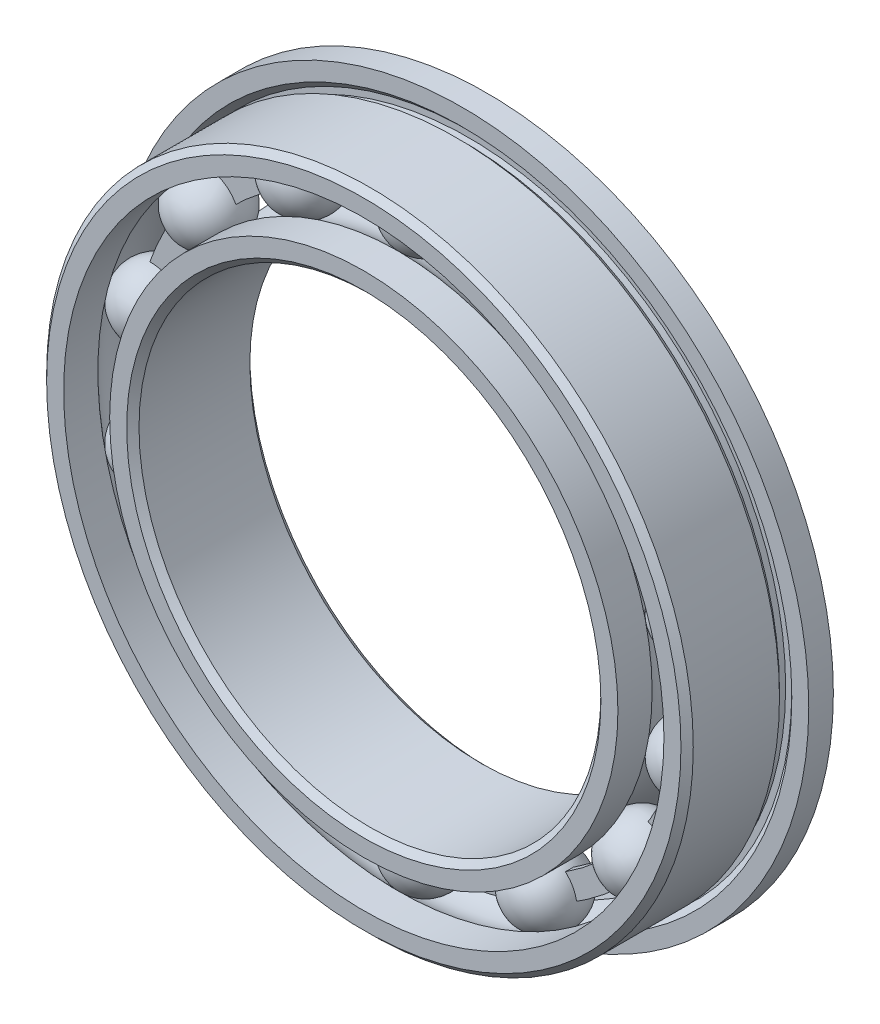
ISO-10303-21;
HEADER;
FILE_DESCRIPTION(('STEP AP214'),'2;1');
FILE_NAME('part.step','',(''),(''),'','','');
FILE_SCHEMA(('AUTOMOTIVE_DESIGN { 1 0 10303 214 1 1 1 1 }'));
ENDSEC;
DATA;
#1=APPLICATION_CONTEXT('core data for automotive mechanical design processes');
#2=APPLICATION_PROTOCOL_DEFINITION('international standard','automotive_design',2000,#1);
#3=PRODUCT_CONTEXT('',#1,'mechanical');
#4=PRODUCT('Part','Part','',(#3));
#5=PRODUCT_RELATED_PRODUCT_CATEGORY('part','',(#4));
#6=PRODUCT_DEFINITION_FORMATION('','',#4);
#7=PRODUCT_DEFINITION_CONTEXT('part definition',#1,'design');
#8=PRODUCT_DEFINITION('design','',#6,#7);
#9=PRODUCT_DEFINITION_SHAPE('','',#8);
#10=(LENGTH_UNIT() NAMED_UNIT(*) SI_UNIT(.MILLI.,.METRE.));
#11=(NAMED_UNIT(*) PLANE_ANGLE_UNIT() SI_UNIT($,.RADIAN.));
#12=(NAMED_UNIT(*) SI_UNIT($,.STERADIAN.) SOLID_ANGLE_UNIT());
#13=UNCERTAINTY_MEASURE_WITH_UNIT(LENGTH_MEASURE(1.E-05),#10,'distance_accuracy_value','');
#14=(GEOMETRIC_REPRESENTATION_CONTEXT(3) GLOBAL_UNCERTAINTY_ASSIGNED_CONTEXT((#13)) GLOBAL_UNIT_ASSIGNED_CONTEXT((#10,
#11,#12)) REPRESENTATION_CONTEXT('',''));
#15=CARTESIAN_POINT('',(0.,0.,0.));
#16=DIRECTION('',(0.,0.,1.));
#17=DIRECTION('',(1.,0.,0.));
#18=AXIS2_PLACEMENT_3D('',#15,#16,#17);
#19=CARTESIAN_POINT('',(-3.90495365205792,8.10871981112182,0.));
#20=DIRECTION('',(0.,0.,1.));
#21=DIRECTION('',(-0.433883739117546,0.900968867902425,0.));
#22=AXIS2_PLACEMENT_3D('',#19,#20,#21);
#23=SPHERICAL_SURFACE('',#22,1.16125368678291);
#24=CARTESIAN_POINT('',(-3.90495365205792,8.10871981112182,1.16125368678291));
#25=VERTEX_POINT('',#24);
#26=VERTEX_LOOP('',#25);
#27=FACE_BOUND('',#26,.T.);
#28=ADVANCED_FACE('F42',(#27),#23,.T.);
#29=CLOSED_SHELL('',(#28));
#30=MANIFOLD_SOLID_BREP('B2',#29);
#31=CARTESIAN_POINT('',(-7.0364833422122,5.61140821672869,0.));
#32=DIRECTION('',(0.,0.,1.));
#33=DIRECTION('',(-0.781831482468022,0.623489801858743,0.));
#34=AXIS2_PLACEMENT_3D('',#31,#32,#33);
#35=SPHERICAL_SURFACE('',#34,1.16125368678291);
#36=CARTESIAN_POINT('',(-7.0364833422122,5.61140821672869,1.16125368678291));
#37=VERTEX_POINT('',#36);
#38=VERTEX_LOOP('',#37);
#39=FACE_BOUND('',#38,.T.);
#40=ADVANCED_FACE('F63',(#39),#35,.T.);
#41=CLOSED_SHELL('',(#40));
#42=MANIFOLD_SOLID_BREP('B6',#41);
#43=CARTESIAN_POINT('',(-8.77435120963639,2.00268840560692,0.));
#44=DIRECTION('',(0.,0.,1.));
#45=DIRECTION('',(-0.974927912181821,0.222520933956325,0.));
#46=AXIS2_PLACEMENT_3D('',#43,#44,#45);
#47=SPHERICAL_SURFACE('',#46,1.16125368678291);
#48=CARTESIAN_POINT('',(-8.77435120963639,2.00268840560692,1.16125368678291));
#49=VERTEX_POINT('',#48);
#50=VERTEX_LOOP('',#49);
#51=FACE_BOUND('',#50,.T.);
#52=ADVANCED_FACE('F84',(#51),#47,.T.);
#53=CLOSED_SHELL('',(#52));
#54=MANIFOLD_SOLID_BREP('B38',#53);
#55=CARTESIAN_POINT('',(-8.77435120963643,-2.00268840560675,0.));
#56=DIRECTION('',(0.,0.,1.));
#57=DIRECTION('',(-0.974927912181826,-0.222520933956305,0.));
#58=AXIS2_PLACEMENT_3D('',#55,#56,#57);
#59=SPHERICAL_SURFACE('',#58,1.16125368678291);
#60=CARTESIAN_POINT('',(-8.77435120963643,-2.00268840560675,1.16125368678291));
#61=VERTEX_POINT('',#60);
#62=VERTEX_LOOP('',#61);
#63=FACE_BOUND('',#62,.T.);
#64=ADVANCED_FACE('F105',(#63),#59,.T.);
#65=CLOSED_SHELL('',(#64));
#66=MANIFOLD_SOLID_BREP('B59',#65);
#67=CARTESIAN_POINT('',(-7.03648334221232,-5.61140821672854,0.));
#68=DIRECTION('',(0.,0.,1.));
#69=DIRECTION('',(-0.781831482468035,-0.623489801858727,0.));
#70=AXIS2_PLACEMENT_3D('',#67,#68,#69);
#71=SPHERICAL_SURFACE('',#70,1.16125368678291);
#72=CARTESIAN_POINT('',(-7.03648334221232,-5.61140821672854,1.16125368678291));
#73=VERTEX_POINT('',#72);
#74=VERTEX_LOOP('',#73);
#75=FACE_BOUND('',#74,.T.);
#76=ADVANCED_FACE('F126',(#75),#71,.T.);
#77=CLOSED_SHELL('',(#76));
#78=MANIFOLD_SOLID_BREP('B80',#77);
#79=CARTESIAN_POINT('',(-3.90495365205809,-8.10871981112174,0.));
#80=DIRECTION('',(0.,0.,1.));
#81=DIRECTION('',(-0.433883739117565,-0.900968867902416,0.));
#82=AXIS2_PLACEMENT_3D('',#79,#80,#81);
#83=SPHERICAL_SURFACE('',#82,1.16125368678291);
#84=CARTESIAN_POINT('',(-3.90495365205809,-8.10871981112174,1.16125368678291));
#85=VERTEX_POINT('',#84);
#86=VERTEX_LOOP('',#85);
#87=FACE_BOUND('',#86,.T.);
#88=ADVANCED_FACE('F147',(#87),#83,.T.);
#89=CLOSED_SHELL('',(#88));
#90=MANIFOLD_SOLID_BREP('B101',#89);
#91=CARTESIAN_POINT('',(0.,-9.,0.));
#92=DIRECTION('',(0.,0.,1.));
#93=DIRECTION('',(0.,-1.,0.));
#94=AXIS2_PLACEMENT_3D('',#91,#92,#93);
#95=SPHERICAL_SURFACE('',#94,1.16125368678291);
#96=CARTESIAN_POINT('',(0.,-9.,1.16125368678291));
#97=VERTEX_POINT('',#96);
#98=VERTEX_LOOP('',#97);
#99=FACE_BOUND('',#98,.T.);
#100=ADVANCED_FACE('F168',(#99),#95,.T.);
#101=CLOSED_SHELL('',(#100));
#102=MANIFOLD_SOLID_BREP('B122',#101);
#103=CARTESIAN_POINT('',(3.90495365205797,-8.1087198111218,0.));
#104=DIRECTION('',(0.,0.,1.));
#105=DIRECTION('',(0.433883739117553,-0.900968867902422,0.));
#106=AXIS2_PLACEMENT_3D('',#103,#104,#105);
#107=SPHERICAL_SURFACE('',#106,1.16125368678291);
#108=CARTESIAN_POINT('',(3.90495365205797,-8.1087198111218,1.16125368678291));
#109=VERTEX_POINT('',#108);
#110=VERTEX_LOOP('',#109);
#111=FACE_BOUND('',#110,.T.);
#112=ADVANCED_FACE('F189',(#111),#107,.T.);
#113=CLOSED_SHELL('',(#112));
#114=MANIFOLD_SOLID_BREP('B143',#113);
#115=CARTESIAN_POINT('',(7.03648334221224,-5.61140821672864,0.));
#116=DIRECTION('',(0.,0.,1.));
#117=DIRECTION('',(0.781831482468027,-0.623489801858737,0.));
#118=AXIS2_PLACEMENT_3D('',#115,#116,#117);
#119=SPHERICAL_SURFACE('',#118,1.16125368678291);
#120=CARTESIAN_POINT('',(7.03648334221224,-5.61140821672864,1.16125368678291));
#121=VERTEX_POINT('',#120);
#122=VERTEX_LOOP('',#121);
#123=FACE_BOUND('',#122,.T.);
#124=ADVANCED_FACE('F210',(#123),#119,.T.);
#125=CLOSED_SHELL('',(#124));
#126=MANIFOLD_SOLID_BREP('B164',#125);
#127=CARTESIAN_POINT('',(8.77435120963641,-2.00268840560686,0.));
#128=DIRECTION('',(0.,0.,1.));
#129=DIRECTION('',(0.974927912181823,-0.222520933956318,0.));
#130=AXIS2_PLACEMENT_3D('',#127,#128,#129);
#131=SPHERICAL_SURFACE('',#130,1.16125368678291);
#132=CARTESIAN_POINT('',(8.77435120963641,-2.00268840560686,1.16125368678291));
#133=VERTEX_POINT('',#132);
#134=VERTEX_LOOP('',#133);
#135=FACE_BOUND('',#134,.T.);
#136=ADVANCED_FACE('F231',(#135),#131,.T.);
#137=CLOSED_SHELL('',(#136));
#138=MANIFOLD_SOLID_BREP('B185',#137);
#139=CARTESIAN_POINT('',(8.77435120963642,2.0026884056068,0.));
#140=DIRECTION('',(0.,0.,1.));
#141=DIRECTION('',(0.974927912181824,0.222520933956311,0.));
#142=AXIS2_PLACEMENT_3D('',#139,#140,#141);
#143=SPHERICAL_SURFACE('',#142,1.16125368678291);
#144=CARTESIAN_POINT('',(8.77435120963642,2.0026884056068,1.16125368678291));
#145=VERTEX_POINT('',#144);
#146=VERTEX_LOOP('',#145);
#147=FACE_BOUND('',#146,.T.);
#148=ADVANCED_FACE('F252',(#147),#143,.T.);
#149=CLOSED_SHELL('',(#148));
#150=MANIFOLD_SOLID_BREP('B206',#149);
#151=CARTESIAN_POINT('',(7.03648334221228,5.61140821672859,0.));
#152=DIRECTION('',(0.,0.,1.));
#153=DIRECTION('',(0.781831482468031,0.623489801858732,0.));
#154=AXIS2_PLACEMENT_3D('',#151,#152,#153);
#155=SPHERICAL_SURFACE('',#154,1.16125368678291);
#156=CARTESIAN_POINT('',(7.03648334221228,5.61140821672859,1.16125368678291));
#157=VERTEX_POINT('',#156);
#158=VERTEX_LOOP('',#157);
#159=FACE_BOUND('',#158,.T.);
#160=ADVANCED_FACE('F273',(#159),#155,.T.);
#161=CLOSED_SHELL('',(#160));
#162=MANIFOLD_SOLID_BREP('B227',#161);
#163=CARTESIAN_POINT('',(3.90495365205803,8.10871981112177,0.));
#164=DIRECTION('',(0.,0.,1.));
#165=DIRECTION('',(0.433883739117559,0.900968867902419,0.));
#166=AXIS2_PLACEMENT_3D('',#163,#164,#165);
#167=SPHERICAL_SURFACE('',#166,1.16125368678291);
#168=CARTESIAN_POINT('',(3.90495365205803,8.10871981112177,1.16125368678291));
#169=VERTEX_POINT('',#168);
#170=VERTEX_LOOP('',#169);
#171=FACE_BOUND('',#170,.T.);
#172=ADVANCED_FACE('F294',(#171),#167,.T.);
#173=CLOSED_SHELL('',(#172));
#174=MANIFOLD_SOLID_BREP('B248',#173);
#175=CARTESIAN_POINT('',(0.,9.,0.));
#176=DIRECTION('',(0.,0.,1.));
#177=DIRECTION('',(0.,1.,0.));
#178=AXIS2_PLACEMENT_3D('',#175,#176,#177);
#179=SPHERICAL_SURFACE('',#178,1.16125368678291);
#180=CARTESIAN_POINT('',(0.,9.,1.16125368678291));
#181=VERTEX_POINT('',#180);
#182=VERTEX_LOOP('',#181);
#183=FACE_BOUND('',#182,.T.);
#184=ADVANCED_FACE('F317',(#183),#179,.T.);
#185=CLOSED_SHELL('',(#184));
#186=MANIFOLD_SOLID_BREP('B269',#185);
#187=CARTESIAN_POINT('',(0.,9.37362637362637,0.124542124542125));
#188=DIRECTION('',(0.,0.,-1.));
#189=DIRECTION('',(-1.,0.,0.));
#190=AXIS2_PLACEMENT_3D('',#187,#188,#189);
#191=PLANE('',#190);
#192=CARTESIAN_POINT('',(0.,0.,0.124542124542125));
#193=DIRECTION('',(0.,0.,1.));
#194=DIRECTION('',(1.,0.,0.));
#195=AXIS2_PLACEMENT_3D('',#192,#193,#194);
#196=CIRCLE('',#195,8.62637362637363);
#197=CARTESIAN_POINT('',(8.62637362637363,0.,0.124542124542125));
#198=VERTEX_POINT('',#197);
#199=EDGE_CURVE('E316',#198,#198,#196,.T.);
#200=ORIENTED_EDGE('',*,*,#199,.F.);
#201=EDGE_LOOP('',(#200));
#202=FACE_BOUND('',#201,.T.);
#203=CARTESIAN_POINT('',(0.,0.,0.124542124542125));
#204=DIRECTION('',(0.,0.,1.));
#205=DIRECTION('',(1.,0.,0.));
#206=AXIS2_PLACEMENT_3D('',#203,#204,#205);
#207=CIRCLE('',#206,9.37362637362637);
#208=CARTESIAN_POINT('',(9.37362637362637,0.,0.124542124542125));
#209=VERTEX_POINT('',#208);
#210=EDGE_CURVE('E352',#209,#209,#207,.T.);
#211=ORIENTED_EDGE('',*,*,#210,.T.);
#212=EDGE_LOOP('',(#211));
#213=FACE_BOUND('',#212,.T.);
#214=ADVANCED_FACE('F338',(#202,#213),#191,.F.);
#215=CARTESIAN_POINT('',(0.,0.,2.));
#216=DIRECTION('',(0.,0.,1.));
#217=DIRECTION('',(1.,0.,0.));
#218=AXIS2_PLACEMENT_3D('',#215,#216,#217);
#219=CYLINDRICAL_SURFACE('',#218,8.62637362637363);
#220=CARTESIAN_POINT('',(0.,0.,-0.124542124542125));
#221=DIRECTION('',(0.,0.,1.));
#222=DIRECTION('',(1.,0.,0.));
#223=AXIS2_PLACEMENT_3D('',#220,#221,#222);
#224=CIRCLE('',#223,8.62637362637363);
#225=CARTESIAN_POINT('',(8.62637362637363,0.,-0.124542124542125));
#226=VERTEX_POINT('',#225);
#227=EDGE_CURVE('E344',#226,#226,#224,.T.);
#228=ORIENTED_EDGE('',*,*,#227,.F.);
#229=EDGE_LOOP('',(#228));
#230=FACE_BOUND('',#229,.T.);
#231=ORIENTED_EDGE('',*,*,#199,.T.);
#232=EDGE_LOOP('',(#231));
#233=FACE_BOUND('',#232,.T.);
#234=ADVANCED_FACE('F367',(#230,#233),#219,.F.);
#235=CARTESIAN_POINT('',(0.,9.37362637362637,-0.124542124542124));
#236=DIRECTION('',(0.,0.,1.));
#237=DIRECTION('',(1.,0.,0.));
#238=AXIS2_PLACEMENT_3D('',#235,#236,#237);
#239=PLANE('',#238);
#240=CARTESIAN_POINT('',(0.,0.,-0.124542124542124));
#241=DIRECTION('',(0.,0.,1.));
#242=DIRECTION('',(1.,0.,0.));
#243=AXIS2_PLACEMENT_3D('',#240,#241,#242);
#244=CIRCLE('',#243,9.37362637362637);
#245=CARTESIAN_POINT('',(9.37362637362637,0.,-0.124542124542124));
#246=VERTEX_POINT('',#245);
#247=EDGE_CURVE('E348',#246,#246,#244,.T.);
#248=ORIENTED_EDGE('',*,*,#247,.F.);
#249=EDGE_LOOP('',(#248));
#250=FACE_BOUND('',#249,.T.);
#251=ORIENTED_EDGE('',*,*,#227,.T.);
#252=EDGE_LOOP('',(#251));
#253=FACE_BOUND('',#252,.T.);
#254=ADVANCED_FACE('F362',(#250,#253),#239,.F.);
#255=CARTESIAN_POINT('',(0.,0.,2.));
#256=DIRECTION('',(0.,0.,1.));
#257=DIRECTION('',(1.,0.,0.));
#258=AXIS2_PLACEMENT_3D('',#255,#256,#257);
#259=CYLINDRICAL_SURFACE('',#258,9.37362637362637);
#260=ORIENTED_EDGE('',*,*,#210,.F.);
#261=EDGE_LOOP('',(#260));
#262=FACE_BOUND('',#261,.T.);
#263=ORIENTED_EDGE('',*,*,#247,.T.);
#264=EDGE_LOOP('',(#263));
#265=FACE_BOUND('',#264,.T.);
#266=ADVANCED_FACE('F359',(#262,#265),#259,.T.);
#267=CLOSED_SHELL('',(#214,#234,#254,#266));
#268=MANIFOLD_SOLID_BREP('B290',#267);
#269=CARTESIAN_POINT('',(0.,8.25274725274725,2.));
#270=DIRECTION('',(0.,0.,-1.));
#271=DIRECTION('',(-1.,0.,0.));
#272=AXIS2_PLACEMENT_3D('',#269,#270,#271);
#273=PLANE('',#272);
#274=CARTESIAN_POINT('',(0.,0.,2.));
#275=DIRECTION('',(0.,0.,1.));
#276=DIRECTION('',(1.,0.,0.));
#277=AXIS2_PLACEMENT_3D('',#274,#275,#276);
#278=CIRCLE('',#277,7.7);
#279=CARTESIAN_POINT('',(7.7,0.,2.));
#280=VERTEX_POINT('',#279);
#281=EDGE_CURVE('E435',#280,#280,#278,.T.);
#282=ORIENTED_EDGE('',*,*,#281,.F.);
#283=EDGE_LOOP('',(#282));
#284=FACE_BOUND('',#283,.T.);
#285=CARTESIAN_POINT('',(0.,0.,2.));
#286=DIRECTION('',(0.,0.,1.));
#287=DIRECTION('',(1.,0.,0.));
#288=AXIS2_PLACEMENT_3D('',#285,#286,#287);
#289=CIRCLE('',#288,8.25274725274725);
#290=CARTESIAN_POINT('',(8.25274725274725,0.,2.));
#291=VERTEX_POINT('',#290);
#292=EDGE_CURVE('E337',#291,#291,#289,.T.);
#293=ORIENTED_EDGE('',*,*,#292,.T.);
#294=EDGE_LOOP('',(#293));
#295=FACE_BOUND('',#294,.T.);
#296=ADVANCED_FACE('F407',(#284,#295),#273,.F.);
#297=CARTESIAN_POINT('',(0.,0.,2.));
#298=DIRECTION('',(0.,0.,1.));
#299=DIRECTION('',(1.,0.,0.));
#300=AXIS2_PLACEMENT_3D('',#297,#298,#299);
#301=CYLINDRICAL_SURFACE('',#300,8.25274725274725);
#302=ORIENTED_EDGE('',*,*,#292,.F.);
#303=EDGE_LOOP('',(#302));
#304=FACE_BOUND('',#303,.T.);
#305=CARTESIAN_POINT('',(0.,0.,0.888888888888889));
#306=DIRECTION('',(0.,0.,1.));
#307=DIRECTION('',(1.,0.,0.));
#308=AXIS2_PLACEMENT_3D('',#305,#306,#307);
#309=CIRCLE('',#308,8.25274725274725);
#310=CARTESIAN_POINT('',(8.25274725274725,0.,0.888888888888889));
#311=VERTEX_POINT('',#310);
#312=EDGE_CURVE('E413',#311,#311,#309,.T.);
#313=ORIENTED_EDGE('',*,*,#312,.T.);
#314=EDGE_LOOP('',(#313));
#315=FACE_BOUND('',#314,.T.);
#316=ADVANCED_FACE('F442',(#304,#315),#301,.T.);
#317=CARTESIAN_POINT('',(0.,0.,0.));
#318=DIRECTION('',(0.,0.,1.));
#319=DIRECTION('',(1.,0.,0.));
#320=AXIS2_PLACEMENT_3D('',#317,#318,#319);
#321=TOROIDAL_SURFACE('',#320,8.99999999999999,1.16125368678291);
#322=ORIENTED_EDGE('',*,*,#312,.F.);
#323=EDGE_LOOP('',(#322));
#324=FACE_BOUND('',#323,.T.);
#325=CARTESIAN_POINT('',(0.,0.,-0.88888888888889));
#326=DIRECTION('',(0.,0.,1.));
#327=DIRECTION('',(1.,0.,0.));
#328=AXIS2_PLACEMENT_3D('',#325,#326,#327);
#329=CIRCLE('',#328,8.25274725274725);
#330=CARTESIAN_POINT('',(8.25274725274725,0.,-0.88888888888889));
#331=VERTEX_POINT('',#330);
#332=EDGE_CURVE('E417',#331,#331,#329,.T.);
#333=ORIENTED_EDGE('',*,*,#332,.T.);
#334=EDGE_LOOP('',(#333));
#335=FACE_BOUND('',#334,.T.);
#336=ADVANCED_FACE('F446',(#324,#335),#321,.F.);
#337=CARTESIAN_POINT('',(0.,0.,2.));
#338=DIRECTION('',(0.,0.,1.));
#339=DIRECTION('',(1.,0.,0.));
#340=AXIS2_PLACEMENT_3D('',#337,#338,#339);
#341=CYLINDRICAL_SURFACE('',#340,8.25274725274725);
#342=ORIENTED_EDGE('',*,*,#332,.F.);
#343=EDGE_LOOP('',(#342));
#344=FACE_BOUND('',#343,.T.);
#345=CARTESIAN_POINT('',(0.,0.,-2.));
#346=DIRECTION('',(0.,0.,1.));
#347=DIRECTION('',(1.,0.,0.));
#348=AXIS2_PLACEMENT_3D('',#345,#346,#347);
#349=CIRCLE('',#348,8.25274725274725);
#350=CARTESIAN_POINT('',(8.25274725274725,0.,-2.));
#351=VERTEX_POINT('',#350);
#352=EDGE_CURVE('E421',#351,#351,#349,.T.);
#353=ORIENTED_EDGE('',*,*,#352,.T.);
#354=EDGE_LOOP('',(#353));
#355=FACE_BOUND('',#354,.T.);
#356=ADVANCED_FACE('F451',(#344,#355),#341,.T.);
#357=CARTESIAN_POINT('',(0.,7.7,-2.));
#358=DIRECTION('',(0.,0.,1.));
#359=DIRECTION('',(1.,0.,0.));
#360=AXIS2_PLACEMENT_3D('',#357,#358,#359);
#361=PLANE('',#360);
#362=ORIENTED_EDGE('',*,*,#352,.F.);
#363=EDGE_LOOP('',(#362));
#364=FACE_BOUND('',#363,.T.);
#365=CARTESIAN_POINT('',(0.,0.,-2.));
#366=DIRECTION('',(0.,0.,1.));
#367=DIRECTION('',(1.,0.,0.));
#368=AXIS2_PLACEMENT_3D('',#365,#366,#367);
#369=CIRCLE('',#368,7.7);
#370=CARTESIAN_POINT('',(7.7,0.,-2.));
#371=VERTEX_POINT('',#370);
#372=EDGE_CURVE('E426',#371,#371,#369,.T.);
#373=ORIENTED_EDGE('',*,*,#372,.T.);
#374=EDGE_LOOP('',(#373));
#375=FACE_BOUND('',#374,.T.);
#376=ADVANCED_FACE('F457',(#364,#375),#361,.F.);
#377=CARTESIAN_POINT('',(0.,0.,-1.8));
#378=DIRECTION('',(0.,0.,-1.));
#379=DIRECTION('',(-1.,0.,0.));
#380=AXIS2_PLACEMENT_3D('',#377,#378,#379);
#381=CONICAL_SURFACE('',#380,7.5,0.785398163397458);
#382=ORIENTED_EDGE('',*,*,#372,.F.);
#383=EDGE_LOOP('',(#382));
#384=FACE_BOUND('',#383,.T.);
#385=CARTESIAN_POINT('',(0.,0.,-1.8));
#386=DIRECTION('',(0.,0.,1.));
#387=DIRECTION('',(1.,0.,0.));
#388=AXIS2_PLACEMENT_3D('',#385,#386,#387);
#389=CIRCLE('',#388,7.5);
#390=CARTESIAN_POINT('',(7.5,0.,-1.8));
#391=VERTEX_POINT('',#390);
#392=EDGE_CURVE('E429',#391,#391,#389,.T.);
#393=ORIENTED_EDGE('',*,*,#392,.T.);
#394=EDGE_LOOP('',(#393));
#395=FACE_BOUND('',#394,.T.);
#396=ADVANCED_FACE('F461',(#384,#395),#381,.F.);
#397=CARTESIAN_POINT('',(0.,0.,2.));
#398=DIRECTION('',(0.,0.,1.));
#399=DIRECTION('',(1.,0.,0.));
#400=AXIS2_PLACEMENT_3D('',#397,#398,#399);
#401=CYLINDRICAL_SURFACE('',#400,7.5);
#402=ORIENTED_EDGE('',*,*,#392,.F.);
#403=EDGE_LOOP('',(#402));
#404=FACE_BOUND('',#403,.T.);
#405=CARTESIAN_POINT('',(0.,0.,1.79999999999999));
#406=DIRECTION('',(0.,0.,1.));
#407=DIRECTION('',(1.,0.,0.));
#408=AXIS2_PLACEMENT_3D('',#405,#406,#407);
#409=CIRCLE('',#408,7.5);
#410=CARTESIAN_POINT('',(7.5,0.,1.79999999999999));
#411=VERTEX_POINT('',#410);
#412=EDGE_CURVE('E432',#411,#411,#409,.T.);
#413=ORIENTED_EDGE('',*,*,#412,.T.);
#414=EDGE_LOOP('',(#413));
#415=FACE_BOUND('',#414,.T.);
#416=ADVANCED_FACE('F465',(#404,#415),#401,.F.);
#417=CARTESIAN_POINT('',(0.,0.,2.));
#418=DIRECTION('',(0.,0.,1.));
#419=DIRECTION('',(1.,0.,0.));
#420=AXIS2_PLACEMENT_3D('',#417,#418,#419);
#421=CONICAL_SURFACE('',#420,7.7,0.785398163397437);
#422=ORIENTED_EDGE('',*,*,#412,.F.);
#423=EDGE_LOOP('',(#422));
#424=FACE_BOUND('',#423,.T.);
#425=ORIENTED_EDGE('',*,*,#281,.T.);
#426=EDGE_LOOP('',(#425));
#427=FACE_BOUND('',#426,.T.);
#428=ADVANCED_FACE('F439',(#424,#427),#421,.F.);
#429=CLOSED_SHELL('',(#296,#316,#336,#356,#376,#396,#416,#428));
#430=MANIFOLD_SOLID_BREP('B311',#429);
#431=CARTESIAN_POINT('',(0.,0.,2.));
#432=DIRECTION('',(0.,0.,1.));
#433=DIRECTION('',(1.,0.,0.));
#434=AXIS2_PLACEMENT_3D('',#431,#432,#433);
#435=CYLINDRICAL_SURFACE('',#434,10.5);
#436=CARTESIAN_POINT('',(0.,0.,1.8));
#437=DIRECTION('',(0.,0.,1.));
#438=DIRECTION('',(1.,0.,0.));
#439=AXIS2_PLACEMENT_3D('',#436,#437,#438);
#440=CIRCLE('',#439,10.5);
#441=CARTESIAN_POINT('',(10.5,0.,1.8));
#442=VERTEX_POINT('',#441);
#443=EDGE_CURVE('E572',#442,#442,#440,.T.);
#444=ORIENTED_EDGE('',*,*,#443,.F.);
#445=EDGE_LOOP('',(#444));
#446=FACE_BOUND('',#445,.T.);
#447=CARTESIAN_POINT('',(0.,0.,-0.999999999999998));
#448=DIRECTION('',(0.,0.,1.));
#449=DIRECTION('',(1.,0.,0.));
#450=AXIS2_PLACEMENT_3D('',#447,#448,#449);
#451=CIRCLE('',#450,10.5);
#452=CARTESIAN_POINT('',(10.5,0.,-0.999999999999998));
#453=VERTEX_POINT('',#452);
#454=EDGE_CURVE('E406',#453,#453,#451,.T.);
#455=ORIENTED_EDGE('',*,*,#454,.T.);
#456=EDGE_LOOP('',(#455));
#457=FACE_BOUND('',#456,.T.);
#458=ADVANCED_FACE('F529',(#446,#457),#435,.T.);
#459=CARTESIAN_POINT('',(0.,0.,-1.2));
#460=DIRECTION('',(0.,0.,1.));
#461=DIRECTION('',(1.,0.,0.));
#462=AXIS2_PLACEMENT_3D('',#459,#460,#461);
#463=CONICAL_SURFACE('',#462,10.3,0.785398163397437);
#464=ORIENTED_EDGE('',*,*,#454,.F.);
#465=EDGE_LOOP('',(#464));
#466=FACE_BOUND('',#465,.T.);
#467=CARTESIAN_POINT('',(0.,0.,-1.2));
#468=DIRECTION('',(0.,0.,1.));
#469=DIRECTION('',(1.,0.,0.));
#470=AXIS2_PLACEMENT_3D('',#467,#468,#469);
#471=CIRCLE('',#470,10.3);
#472=CARTESIAN_POINT('',(10.3,0.,-1.2));
#473=VERTEX_POINT('',#472);
#474=EDGE_CURVE('E535',#473,#473,#471,.T.);
#475=ORIENTED_EDGE('',*,*,#474,.T.);
#476=EDGE_LOOP('',(#475));
#477=FACE_BOUND('',#476,.T.);
#478=ADVANCED_FACE('F579',(#466,#477),#463,.T.);
#479=CARTESIAN_POINT('',(0.,0.,2.));
#480=DIRECTION('',(0.,0.,1.));
#481=DIRECTION('',(1.,0.,0.));
#482=AXIS2_PLACEMENT_3D('',#479,#480,#481);
#483=CYLINDRICAL_SURFACE('',#482,10.3);
#484=ORIENTED_EDGE('',*,*,#474,.F.);
#485=EDGE_LOOP('',(#484));
#486=FACE_BOUND('',#485,.T.);
#487=CARTESIAN_POINT('',(0.,0.,-1.4));
#488=DIRECTION('',(0.,0.,1.));
#489=DIRECTION('',(1.,0.,0.));
#490=AXIS2_PLACEMENT_3D('',#487,#488,#489);
#491=CIRCLE('',#490,10.3);
#492=CARTESIAN_POINT('',(10.3,0.,-1.4));
#493=VERTEX_POINT('',#492);
#494=EDGE_CURVE('E539',#493,#493,#491,.T.);
#495=ORIENTED_EDGE('',*,*,#494,.T.);
#496=EDGE_LOOP('',(#495));
#497=FACE_BOUND('',#496,.T.);
#498=ADVANCED_FACE('F583',(#486,#497),#483,.T.);
#499=CARTESIAN_POINT('',(0.,10.5,-1.4));
#500=DIRECTION('',(0.,0.,-1.));
#501=DIRECTION('',(-1.,0.,0.));
#502=AXIS2_PLACEMENT_3D('',#499,#500,#501);
#503=PLANE('',#502);
#504=ORIENTED_EDGE('',*,*,#494,.F.);
#505=EDGE_LOOP('',(#504));
#506=FACE_BOUND('',#505,.T.);
#507=CARTESIAN_POINT('',(0.,0.,-1.4));
#508=DIRECTION('',(0.,0.,1.));
#509=DIRECTION('',(1.,0.,0.));
#510=AXIS2_PLACEMENT_3D('',#507,#508,#509);
#511=CIRCLE('',#510,10.5);
#512=CARTESIAN_POINT('',(10.5,0.,-1.4));
#513=VERTEX_POINT('',#512);
#514=EDGE_CURVE('E543',#513,#513,#511,.T.);
#515=ORIENTED_EDGE('',*,*,#514,.T.);
#516=EDGE_LOOP('',(#515));
#517=FACE_BOUND('',#516,.T.);
#518=ADVANCED_FACE('F588',(#506,#517),#503,.F.);
#519=CARTESIAN_POINT('',(0.,0.,-1.2));
#520=DIRECTION('',(0.,0.,1.));
#521=DIRECTION('',(1.,0.,0.));
#522=AXIS2_PLACEMENT_3D('',#519,#520,#521);
#523=CONICAL_SURFACE('',#522,10.7,0.785398163397445);
#524=ORIENTED_EDGE('',*,*,#514,.F.);
#525=EDGE_LOOP('',(#524));
#526=FACE_BOUND('',#525,.T.);
#527=CARTESIAN_POINT('',(0.,0.,-1.2));
#528=DIRECTION('',(0.,0.,1.));
#529=DIRECTION('',(1.,0.,0.));
#530=AXIS2_PLACEMENT_3D('',#527,#528,#529);
#531=CIRCLE('',#530,10.7);
#532=CARTESIAN_POINT('',(10.7,0.,-1.2));
#533=VERTEX_POINT('',#532);
#534=EDGE_CURVE('E548',#533,#533,#531,.T.);
#535=ORIENTED_EDGE('',*,*,#534,.T.);
#536=EDGE_LOOP('',(#535));
#537=FACE_BOUND('',#536,.T.);
#538=ADVANCED_FACE('F594',(#526,#537),#523,.F.);
#539=CARTESIAN_POINT('',(0.,11.25,-1.2));
#540=DIRECTION('',(0.,0.,-1.));
#541=DIRECTION('',(-1.,0.,0.));
#542=AXIS2_PLACEMENT_3D('',#539,#540,#541);
#543=PLANE('',#542);
#544=ORIENTED_EDGE('',*,*,#534,.F.);
#545=EDGE_LOOP('',(#544));
#546=FACE_BOUND('',#545,.T.);
#547=CARTESIAN_POINT('',(0.,0.,-1.2));
#548=DIRECTION('',(0.,0.,1.));
#549=DIRECTION('',(1.,0.,0.));
#550=AXIS2_PLACEMENT_3D('',#547,#548,#549);
#551=CIRCLE('',#550,11.25);
#552=CARTESIAN_POINT('',(11.25,0.,-1.2));
#553=VERTEX_POINT('',#552);
#554=EDGE_CURVE('E551',#553,#553,#551,.T.);
#555=ORIENTED_EDGE('',*,*,#554,.T.);
#556=EDGE_LOOP('',(#555));
#557=FACE_BOUND('',#556,.T.);
#558=ADVANCED_FACE('F598',(#546,#557),#543,.F.);
#559=CARTESIAN_POINT('',(0.,0.,2.));
#560=DIRECTION('',(0.,0.,1.));
#561=DIRECTION('',(1.,0.,0.));
#562=AXIS2_PLACEMENT_3D('',#559,#560,#561);
#563=CYLINDRICAL_SURFACE('',#562,11.25);
#564=ORIENTED_EDGE('',*,*,#554,.F.);
#565=EDGE_LOOP('',(#564));
#566=FACE_BOUND('',#565,.T.);
#567=CARTESIAN_POINT('',(0.,0.,-2.));
#568=DIRECTION('',(0.,0.,1.));
#569=DIRECTION('',(1.,0.,0.));
#570=AXIS2_PLACEMENT_3D('',#567,#568,#569);
#571=CIRCLE('',#570,11.25);
#572=CARTESIAN_POINT('',(11.25,0.,-2.));
#573=VERTEX_POINT('',#572);
#574=EDGE_CURVE('E554',#573,#573,#571,.T.);
#575=ORIENTED_EDGE('',*,*,#574,.T.);
#576=EDGE_LOOP('',(#575));
#577=FACE_BOUND('',#576,.T.);
#578=ADVANCED_FACE('F602',(#566,#577),#563,.T.);
#579=CARTESIAN_POINT('',(0.,10.3,-2.));
#580=DIRECTION('',(0.,0.,1.));
#581=DIRECTION('',(1.,0.,0.));
#582=AXIS2_PLACEMENT_3D('',#579,#580,#581);
#583=PLANE('',#582);
#584=ORIENTED_EDGE('',*,*,#574,.F.);
#585=EDGE_LOOP('',(#584));
#586=FACE_BOUND('',#585,.T.);
#587=CARTESIAN_POINT('',(0.,0.,-2.));
#588=DIRECTION('',(0.,0.,1.));
#589=DIRECTION('',(1.,0.,0.));
#590=AXIS2_PLACEMENT_3D('',#587,#588,#589);
#591=CIRCLE('',#590,9.74725274725275);
#592=CARTESIAN_POINT('',(9.74725274725275,0.,-2.));
#593=VERTEX_POINT('',#592);
#594=EDGE_CURVE('E557',#593,#593,#591,.T.);
#595=ORIENTED_EDGE('',*,*,#594,.T.);
#596=EDGE_LOOP('',(#595));
#597=FACE_BOUND('',#596,.T.);
#598=ADVANCED_FACE('F606',(#586,#597),#583,.F.);
#599=CARTESIAN_POINT('',(0.,0.,2.));
#600=DIRECTION('',(0.,0.,1.));
#601=DIRECTION('',(1.,0.,0.));
#602=AXIS2_PLACEMENT_3D('',#599,#600,#601);
#603=CYLINDRICAL_SURFACE('',#602,9.74725274725275);
#604=ORIENTED_EDGE('',*,*,#594,.F.);
#605=EDGE_LOOP('',(#604));
#606=FACE_BOUND('',#605,.T.);
#607=CARTESIAN_POINT('',(0.,0.,-0.888888888888889));
#608=DIRECTION('',(0.,0.,1.));
#609=DIRECTION('',(1.,0.,0.));
#610=AXIS2_PLACEMENT_3D('',#607,#608,#609);
#611=CIRCLE('',#610,9.74725274725275);
#612=CARTESIAN_POINT('',(9.74725274725275,0.,-0.888888888888889));
#613=VERTEX_POINT('',#612);
#614=EDGE_CURVE('E560',#613,#613,#611,.T.);
#615=ORIENTED_EDGE('',*,*,#614,.T.);
#616=EDGE_LOOP('',(#615));
#617=FACE_BOUND('',#616,.T.);
#618=ADVANCED_FACE('F610',(#606,#617),#603,.F.);
#619=CARTESIAN_POINT('',(0.,0.,0.));
#620=DIRECTION('',(0.,0.,1.));
#621=DIRECTION('',(1.,0.,0.));
#622=AXIS2_PLACEMENT_3D('',#619,#620,#621);
#623=TOROIDAL_SURFACE('',#622,9.,1.16125368678291);
#624=ORIENTED_EDGE('',*,*,#614,.F.);
#625=EDGE_LOOP('',(#624));
#626=FACE_BOUND('',#625,.T.);
#627=CARTESIAN_POINT('',(0.,0.,0.888888888888889));
#628=DIRECTION('',(0.,0.,1.));
#629=DIRECTION('',(1.,0.,0.));
#630=AXIS2_PLACEMENT_3D('',#627,#628,#629);
#631=CIRCLE('',#630,9.74725274725275);
#632=CARTESIAN_POINT('',(9.74725274725275,0.,0.888888888888889));
#633=VERTEX_POINT('',#632);
#634=EDGE_CURVE('E563',#633,#633,#631,.T.);
#635=ORIENTED_EDGE('',*,*,#634,.T.);
#636=EDGE_LOOP('',(#635));
#637=FACE_BOUND('',#636,.T.);
#638=ADVANCED_FACE('F614',(#626,#637),#623,.F.);
#639=CARTESIAN_POINT('',(0.,0.,2.));
#640=DIRECTION('',(0.,0.,1.));
#641=DIRECTION('',(1.,0.,0.));
#642=AXIS2_PLACEMENT_3D('',#639,#640,#641);
#643=CYLINDRICAL_SURFACE('',#642,9.74725274725275);
#644=ORIENTED_EDGE('',*,*,#634,.F.);
#645=EDGE_LOOP('',(#644));
#646=FACE_BOUND('',#645,.T.);
#647=CARTESIAN_POINT('',(0.,0.,2.));
#648=DIRECTION('',(0.,0.,1.));
#649=DIRECTION('',(1.,0.,0.));
#650=AXIS2_PLACEMENT_3D('',#647,#648,#649);
#651=CIRCLE('',#650,9.74725274725275);
#652=CARTESIAN_POINT('',(9.74725274725275,0.,2.));
#653=VERTEX_POINT('',#652);
#654=EDGE_CURVE('E566',#653,#653,#651,.T.);
#655=ORIENTED_EDGE('',*,*,#654,.T.);
#656=EDGE_LOOP('',(#655));
#657=FACE_BOUND('',#656,.T.);
#658=ADVANCED_FACE('F618',(#646,#657),#643,.F.);
#659=CARTESIAN_POINT('',(0.,10.3,2.));
#660=DIRECTION('',(0.,0.,-1.));
#661=DIRECTION('',(-1.,0.,0.));
#662=AXIS2_PLACEMENT_3D('',#659,#660,#661);
#663=PLANE('',#662);
#664=ORIENTED_EDGE('',*,*,#654,.F.);
#665=EDGE_LOOP('',(#664));
#666=FACE_BOUND('',#665,.T.);
#667=CARTESIAN_POINT('',(0.,0.,2.));
#668=DIRECTION('',(0.,0.,1.));
#669=DIRECTION('',(1.,0.,0.));
#670=AXIS2_PLACEMENT_3D('',#667,#668,#669);
#671=CIRCLE('',#670,10.3);
#672=CARTESIAN_POINT('',(10.3,0.,2.));
#673=VERTEX_POINT('',#672);
#674=EDGE_CURVE('E569',#673,#673,#671,.T.);
#675=ORIENTED_EDGE('',*,*,#674,.T.);
#676=EDGE_LOOP('',(#675));
#677=FACE_BOUND('',#676,.T.);
#678=ADVANCED_FACE('F622',(#666,#677),#663,.F.);
#679=CARTESIAN_POINT('',(0.,0.,1.8));
#680=DIRECTION('',(0.,0.,-1.));
#681=DIRECTION('',(-1.,0.,0.));
#682=AXIS2_PLACEMENT_3D('',#679,#680,#681);
#683=CONICAL_SURFACE('',#682,10.5,0.785398163397458);
#684=ORIENTED_EDGE('',*,*,#674,.F.);
#685=EDGE_LOOP('',(#684));
#686=FACE_BOUND('',#685,.T.);
#687=ORIENTED_EDGE('',*,*,#443,.T.);
#688=EDGE_LOOP('',(#687));
#689=FACE_BOUND('',#688,.T.);
#690=ADVANCED_FACE('F576',(#686,#689),#683,.T.);
#691=CLOSED_SHELL('',(#458,#478,#498,#518,#538,#558,#578,#598,#618,#638,#658,#678,#690));
#692=MANIFOLD_SOLID_BREP('B332',#691);
#693=ADVANCED_BREP_SHAPE_REPRESENTATION('',(#18,#30,#42,#54,#66,#78,#90,#102,#114,#126,#138,
#150,#162,#174,#186,#268,#430,#692),#14);
#694=SHAPE_DEFINITION_REPRESENTATION(#9,#693);
ENDSEC;
END-ISO-10303-21;
